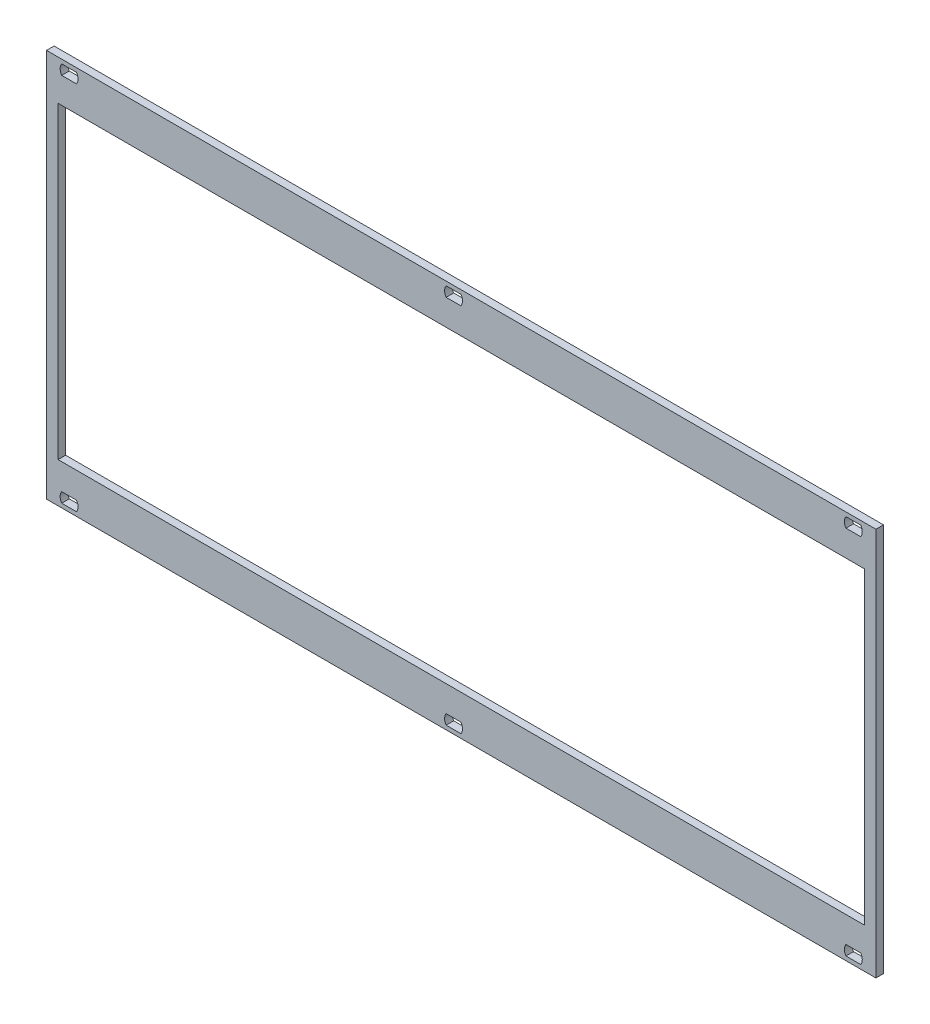
ISO-10303-21;
HEADER;
FILE_DESCRIPTION(('STEP AP214'),'2;1');
FILE_NAME('part.step','',(''),(''),'','','');
FILE_SCHEMA(('AUTOMOTIVE_DESIGN { 1 0 10303 214 1 1 1 1 }'));
ENDSEC;
DATA;
#1=APPLICATION_CONTEXT('core data for automotive mechanical design processes');
#2=APPLICATION_PROTOCOL_DEFINITION('international standard','automotive_design',2000,#1);
#3=PRODUCT_CONTEXT('',#1,'mechanical');
#4=PRODUCT('Part','Part','',(#3));
#5=PRODUCT_RELATED_PRODUCT_CATEGORY('part','',(#4));
#6=PRODUCT_DEFINITION_FORMATION('','',#4);
#7=PRODUCT_DEFINITION_CONTEXT('part definition',#1,'design');
#8=PRODUCT_DEFINITION('design','',#6,#7);
#9=PRODUCT_DEFINITION_SHAPE('','',#8);
#10=(LENGTH_UNIT() NAMED_UNIT(*) SI_UNIT(.MILLI.,.METRE.));
#11=(NAMED_UNIT(*) PLANE_ANGLE_UNIT() SI_UNIT($,.RADIAN.));
#12=(NAMED_UNIT(*) SI_UNIT($,.STERADIAN.) SOLID_ANGLE_UNIT());
#13=UNCERTAINTY_MEASURE_WITH_UNIT(LENGTH_MEASURE(1.E-05),#10,'distance_accuracy_value','');
#14=(GEOMETRIC_REPRESENTATION_CONTEXT(3) GLOBAL_UNCERTAINTY_ASSIGNED_CONTEXT((#13)) GLOBAL_UNIT_ASSIGNED_CONTEXT((#10,
#11,#12)) REPRESENTATION_CONTEXT('',''));
#15=CARTESIAN_POINT('',(0.,0.,0.));
#16=DIRECTION('',(0.,0.,1.));
#17=DIRECTION('',(1.,0.,0.));
#18=AXIS2_PLACEMENT_3D('',#15,#16,#17);
#19=CARTESIAN_POINT('',(-46.657159924507,-6.8405717611313,-2.5));
#20=DIRECTION('',(0.,0.,-1.));
#21=DIRECTION('',(1.,0.,0.));
#22=AXIS2_PLACEMENT_3D('',#19,#20,#21);
#23=PLANE('',#22);
#24=DIRECTION('',(-1.,0.,0.));
#25=VECTOR('',#24,1.);
#26=CARTESIAN_POINT('',(97.1823339068895,-125.22056295395,-2.5));
#27=LINE('',#26,#25);
#28=CARTESIAN_POINT('',(230.35733390689,-125.22056295395,-2.5));
#29=VERTEX_POINT('',#28);
#30=CARTESIAN_POINT('',(-35.992666093111,-125.22056295395,-2.5));
#31=VERTEX_POINT('',#30);
#32=EDGE_CURVE('E475',#29,#31,#27,.T.);
#33=ORIENTED_EDGE('',*,*,#32,.F.);
#34=DIRECTION('',(0.,-1.,0.));
#35=VECTOR('',#34,1.);
#36=CARTESIAN_POINT('',(230.35733390689,-74.2505629539495,-2.5));
#37=LINE('',#36,#35);
#38=CARTESIAN_POINT('',(230.35733390689,-23.280562953949,-2.5));
#39=VERTEX_POINT('',#38);
#40=EDGE_CURVE('E482',#39,#29,#37,.T.);
#41=ORIENTED_EDGE('',*,*,#40,.F.);
#42=DIRECTION('',(1.,0.,0.));
#43=VECTOR('',#42,1.);
#44=CARTESIAN_POINT('',(97.1823339068895,-23.280562953949,-2.5));
#45=LINE('',#44,#43);
#46=CARTESIAN_POINT('',(-35.992666093111,-23.280562953949,-2.5));
#47=VERTEX_POINT('',#46);
#48=EDGE_CURVE('E462',#47,#39,#45,.T.);
#49=ORIENTED_EDGE('',*,*,#48,.F.);
#50=DIRECTION('',(0.,1.,0.));
#51=VECTOR('',#50,1.);
#52=CARTESIAN_POINT('',(-35.992666093111,-74.2505629539495,-2.5));
#53=LINE('',#52,#51);
#54=EDGE_CURVE('E468',#31,#47,#53,.T.);
#55=ORIENTED_EDGE('',*,*,#54,.F.);
#56=EDGE_LOOP('',(#33,#41,#49,#55));
#57=FACE_BOUND('',#56,.T.);
#58=DIRECTION('',(-1.,0.,0.));
#59=VECTOR('',#58,1.);
#60=CARTESIAN_POINT('',(-32.3576660931125,-133.80056295395,-2.5));
#61=LINE('',#60,#59);
#62=CARTESIAN_POINT('',(-29.9122622409854,-133.80056295395,-2.5));
#63=VERTEX_POINT('',#62);
#64=CARTESIAN_POINT('',(-34.8030699452408,-133.80056295395,-2.5));
#65=VERTEX_POINT('',#64);
#66=EDGE_CURVE('E224',#63,#65,#61,.T.);
#67=ORIENTED_EDGE('',*,*,#66,.T.);
#68=CARTESIAN_POINT('',(-32.3576660931077,-135.450562953948,-2.5));
#69=DIRECTION('',(0.,0.,-1.));
#70=DIRECTION('',(-1.,0.,0.));
#71=AXIS2_PLACEMENT_3D('',#68,#69,#70);
#72=CIRCLE('',#71,2.95000000000335);
#73=CARTESIAN_POINT('',(-34.8030699452419,-137.100562953945,-2.5));
#74=VERTEX_POINT('',#73);
#75=EDGE_CURVE('E20',#65,#74,#72,.F.);
#76=ORIENTED_EDGE('',*,*,#75,.T.);
#77=DIRECTION('',(1.,0.,0.));
#78=VECTOR('',#77,1.);
#79=CARTESIAN_POINT('',(-32.3576660931125,-137.10056295395,-2.5));
#80=LINE('',#79,#78);
#81=CARTESIAN_POINT('',(-29.9122622409826,-137.10056295395,-2.5));
#82=VERTEX_POINT('',#81);
#83=EDGE_CURVE('E228',#74,#82,#80,.T.);
#84=ORIENTED_EDGE('',*,*,#83,.T.);
#85=CARTESIAN_POINT('',(-32.3576660931107,-135.450562953954,-2.5));
#86=DIRECTION('',(0.,0.,-1.));
#87=DIRECTION('',(-1.,0.,0.));
#88=AXIS2_PLACEMENT_3D('',#85,#86,#87);
#89=CIRCLE('',#88,2.94999999999935);
#90=EDGE_CURVE('E422',#82,#63,#89,.F.);
#91=ORIENTED_EDGE('',*,*,#90,.T.);
#92=EDGE_LOOP('',(#67,#76,#84,#91));
#93=FACE_BOUND('',#92,.T.);
#94=DIRECTION('',(-1.,0.,0.));
#95=VECTOR('',#94,1.);
#96=CARTESIAN_POINT('',(94.6423339068875,-133.80056295395,-2.5));
#97=LINE('',#96,#95);
#98=CARTESIAN_POINT('',(97.0877377590146,-133.80056295395,-2.5));
#99=VERTEX_POINT('',#98);
#100=CARTESIAN_POINT('',(92.1969300547592,-133.80056295395,-2.5));
#101=VERTEX_POINT('',#100);
#102=EDGE_CURVE('E329',#99,#101,#97,.T.);
#103=ORIENTED_EDGE('',*,*,#102,.T.);
#104=CARTESIAN_POINT('',(94.6423339068947,-135.450562953948,-2.5));
#105=DIRECTION('',(0.,0.,-1.));
#106=DIRECTION('',(-1.,0.,0.));
#107=AXIS2_PLACEMENT_3D('',#104,#105,#106);
#108=CIRCLE('',#107,2.95000000000533);
#109=CARTESIAN_POINT('',(92.1969300547581,-137.100562953945,-2.5));
#110=VERTEX_POINT('',#109);
#111=EDGE_CURVE('E328',#101,#110,#108,.F.);
#112=ORIENTED_EDGE('',*,*,#111,.T.);
#113=DIRECTION('',(1.,0.,0.));
#114=VECTOR('',#113,1.);
#115=CARTESIAN_POINT('',(94.6423339068875,-137.10056295395,-2.5));
#116=LINE('',#115,#114);
#117=CARTESIAN_POINT('',(97.0877377590174,-137.10056295395,-2.5));
#118=VERTEX_POINT('',#117);
#119=EDGE_CURVE('E325',#110,#118,#116,.T.);
#120=ORIENTED_EDGE('',*,*,#119,.T.);
#121=CARTESIAN_POINT('',(94.6423339068883,-135.450562953954,-2.5));
#122=DIRECTION('',(0.,0.,-1.));
#123=DIRECTION('',(-1.,0.,0.));
#124=AXIS2_PLACEMENT_3D('',#121,#122,#123);
#125=CIRCLE('',#124,2.95000000000015);
#126=EDGE_CURVE('E417',#118,#99,#125,.F.);
#127=ORIENTED_EDGE('',*,*,#126,.T.);
#128=EDGE_LOOP('',(#103,#112,#120,#127));
#129=FACE_BOUND('',#128,.T.);
#130=DIRECTION('',(-1.,0.,0.));
#131=VECTOR('',#130,1.);
#132=CARTESIAN_POINT('',(226.72233390689,-133.80056295395,-2.5));
#133=LINE('',#132,#131);
#134=CARTESIAN_POINT('',(229.167737759018,-133.80056295395,-2.5));
#135=VERTEX_POINT('',#134);
#136=CARTESIAN_POINT('',(224.276930054758,-133.80056295395,-2.5));
#137=VERTEX_POINT('',#136);
#138=EDGE_CURVE('E320',#135,#137,#133,.T.);
#139=ORIENTED_EDGE('',*,*,#138,.T.);
#140=CARTESIAN_POINT('',(226.722333906902,-135.450562953948,-2.5));
#141=DIRECTION('',(0.,0.,-1.));
#142=DIRECTION('',(-1.,0.,0.));
#143=AXIS2_PLACEMENT_3D('',#140,#141,#142);
#144=CIRCLE('',#143,2.95000000001495);
#145=CARTESIAN_POINT('',(224.276930054754,-137.100562953945,-2.5));
#146=VERTEX_POINT('',#145);
#147=EDGE_CURVE('E318',#137,#146,#144,.F.);
#148=ORIENTED_EDGE('',*,*,#147,.T.);
#149=DIRECTION('',(1.,0.,0.));
#150=VECTOR('',#149,1.);
#151=CARTESIAN_POINT('',(226.72233390689,-137.10056295395,-2.5));
#152=LINE('',#151,#150);
#153=CARTESIAN_POINT('',(229.167737759021,-137.10056295395,-2.5));
#154=VERTEX_POINT('',#153);
#155=EDGE_CURVE('E315',#146,#154,#152,.T.);
#156=ORIENTED_EDGE('',*,*,#155,.T.);
#157=CARTESIAN_POINT('',(226.722333906873,-135.450562953954,-2.5));
#158=DIRECTION('',(0.,0.,-1.));
#159=DIRECTION('',(-1.,0.,0.));
#160=AXIS2_PLACEMENT_3D('',#157,#158,#159);
#161=CIRCLE('',#160,2.95000000001563);
#162=EDGE_CURVE('E411',#154,#135,#161,.F.);
#163=ORIENTED_EDGE('',*,*,#162,.T.);
#164=EDGE_LOOP('',(#139,#148,#156,#163));
#165=FACE_BOUND('',#164,.T.);
#166=DIRECTION('',(-1.,0.,0.));
#167=VECTOR('',#166,1.);
#168=CARTESIAN_POINT('',(-32.357666093113,-11.400562953949,-2.5));
#169=LINE('',#168,#167);
#170=CARTESIAN_POINT('',(-29.9122622409842,-11.400562953949,-2.5));
#171=VERTEX_POINT('',#170);
#172=CARTESIAN_POINT('',(-34.8030699452411,-11.400562953949,-2.5));
#173=VERTEX_POINT('',#172);
#174=EDGE_CURVE('E310',#171,#173,#169,.T.);
#175=ORIENTED_EDGE('',*,*,#174,.T.);
#176=CARTESIAN_POINT('',(-32.3576660931109,-13.0505629539476,-2.5));
#177=DIRECTION('',(0.,0.,-1.));
#178=DIRECTION('',(-1.,0.,0.));
#179=AXIS2_PLACEMENT_3D('',#176,#177,#178);
#180=CIRCLE('',#179,2.95000000000065);
#181=CARTESIAN_POINT('',(-34.8030699452426,-14.700562953943,-2.5));
#182=VERTEX_POINT('',#181);
#183=EDGE_CURVE('E308',#173,#182,#180,.F.);
#184=ORIENTED_EDGE('',*,*,#183,.T.);
#185=DIRECTION('',(1.,0.,0.));
#186=VECTOR('',#185,1.);
#187=CARTESIAN_POINT('',(-32.357666093113,-14.700562953949,-2.5));
#188=LINE('',#187,#186);
#189=CARTESIAN_POINT('',(-29.9122622409838,-14.700562953949,-2.5));
#190=VERTEX_POINT('',#189);
#191=EDGE_CURVE('E305',#182,#190,#188,.T.);
#192=ORIENTED_EDGE('',*,*,#191,.T.);
#193=CARTESIAN_POINT('',(-32.3576660931133,-13.0505629539496,-2.5));
#194=DIRECTION('',(0.,0.,-1.));
#195=DIRECTION('',(-1.,0.,0.));
#196=AXIS2_PLACEMENT_3D('',#193,#194,#195);
#197=CIRCLE('',#196,2.95000000000147);
#198=EDGE_CURVE('E405',#190,#171,#197,.F.);
#199=ORIENTED_EDGE('',*,*,#198,.T.);
#200=EDGE_LOOP('',(#175,#184,#192,#199));
#201=FACE_BOUND('',#200,.T.);
#202=DIRECTION('',(-1.,0.,0.));
#203=VECTOR('',#202,1.);
#204=CARTESIAN_POINT('',(94.642333906887,-11.400562953948,-2.5));
#205=LINE('',#204,#203);
#206=CARTESIAN_POINT('',(97.0877377590161,-11.400562953948,-2.5));
#207=VERTEX_POINT('',#206);
#208=CARTESIAN_POINT('',(92.1969300547597,-11.400562953948,-2.5));
#209=VERTEX_POINT('',#208);
#210=EDGE_CURVE('E300',#207,#209,#205,.T.);
#211=ORIENTED_EDGE('',*,*,#210,.T.);
#212=CARTESIAN_POINT('',(94.6423339068888,-13.0505629539488,-2.5));
#213=DIRECTION('',(0.,0.,-1.));
#214=DIRECTION('',(-1.,0.,0.));
#215=AXIS2_PLACEMENT_3D('',#212,#213,#214);
#216=CIRCLE('',#215,2.95000000000039);
#217=CARTESIAN_POINT('',(92.1969300547566,-14.7005629539425,-2.5));
#218=VERTEX_POINT('',#217);
#219=EDGE_CURVE('E298',#209,#218,#216,.F.);
#220=ORIENTED_EDGE('',*,*,#219,.T.);
#221=DIRECTION('',(1.,0.,0.));
#222=VECTOR('',#221,1.);
#223=CARTESIAN_POINT('',(94.642333906887,-14.700562953948,-2.5));
#224=LINE('',#223,#222);
#225=CARTESIAN_POINT('',(97.0877377590159,-14.700562953948,-2.5));
#226=VERTEX_POINT('',#225);
#227=EDGE_CURVE('E295',#218,#226,#224,.T.);
#228=ORIENTED_EDGE('',*,*,#227,.T.);
#229=CARTESIAN_POINT('',(94.6423339068884,-13.0505629539476,-2.5));
#230=DIRECTION('',(0.,0.,-1.));
#231=DIRECTION('',(-1.,0.,0.));
#232=AXIS2_PLACEMENT_3D('',#229,#230,#231);
#233=CIRCLE('',#232,2.95000000000012);
#234=EDGE_CURVE('E399',#226,#207,#233,.F.);
#235=ORIENTED_EDGE('',*,*,#234,.T.);
#236=EDGE_LOOP('',(#211,#220,#228,#235));
#237=FACE_BOUND('',#236,.T.);
#238=DIRECTION('',(-1.,0.,0.));
#239=VECTOR('',#238,1.);
#240=CARTESIAN_POINT('',(226.72233390689,-11.400562953947,-2.5));
#241=LINE('',#240,#239);
#242=CARTESIAN_POINT('',(229.16773775902,-11.400562953947,-2.5));
#243=VERTEX_POINT('',#242);
#244=CARTESIAN_POINT('',(224.276930054759,-11.400562953947,-2.5));
#245=VERTEX_POINT('',#244);
#246=EDGE_CURVE('E290',#243,#245,#241,.T.);
#247=ORIENTED_EDGE('',*,*,#246,.T.);
#248=CARTESIAN_POINT('',(226.722333906898,-13.050562953948,-2.5));
#249=DIRECTION('',(0.,0.,-1.));
#250=DIRECTION('',(-1.,0.,0.));
#251=AXIS2_PLACEMENT_3D('',#248,#249,#250);
#252=CIRCLE('',#251,2.95000000001048);
#253=CARTESIAN_POINT('',(224.276930054754,-14.7005629539415,-2.5));
#254=VERTEX_POINT('',#253);
#255=EDGE_CURVE('E288',#245,#254,#252,.F.);
#256=ORIENTED_EDGE('',*,*,#255,.T.);
#257=DIRECTION('',(1.,0.,0.));
#258=VECTOR('',#257,1.);
#259=CARTESIAN_POINT('',(226.72233390689,-14.700562953947,-2.5));
#260=LINE('',#259,#258);
#261=CARTESIAN_POINT('',(229.16773775902,-14.700562953947,-2.5));
#262=VERTEX_POINT('',#261);
#263=EDGE_CURVE('E285',#254,#262,#260,.T.);
#264=ORIENTED_EDGE('',*,*,#263,.T.);
#265=CARTESIAN_POINT('',(226.722333906873,-13.0505629539468,-2.5));
#266=DIRECTION('',(0.,0.,-1.));
#267=DIRECTION('',(-1.,0.,0.));
#268=AXIS2_PLACEMENT_3D('',#265,#266,#267);
#269=CIRCLE('',#268,2.95000000001558);
#270=EDGE_CURVE('E393',#262,#243,#269,.F.);
#271=ORIENTED_EDGE('',*,*,#270,.T.);
#272=EDGE_LOOP('',(#247,#256,#264,#271));
#273=FACE_BOUND('',#272,.T.);
#274=DIRECTION('',(1.,0.,0.));
#275=VECTOR('',#274,1.);
#276=CARTESIAN_POINT('',(97.1823339068895,-138.45056295395,-2.5));
#277=LINE('',#276,#275);
#278=CARTESIAN_POINT('',(-39.807666093111,-138.45056295395,-2.5));
#279=VERTEX_POINT('',#278);
#280=CARTESIAN_POINT('',(234.17233390689,-138.45056295395,-2.5));
#281=VERTEX_POINT('',#280);
#282=EDGE_CURVE('E275',#279,#281,#277,.T.);
#283=ORIENTED_EDGE('',*,*,#282,.F.);
#284=DIRECTION('',(0.,-1.,0.));
#285=VECTOR('',#284,1.);
#286=CARTESIAN_POINT('',(-39.807666093111,-74.2505629539495,-2.5));
#287=LINE('',#286,#285);
#288=CARTESIAN_POINT('',(-39.807666093111,-10.050562953949,-2.5));
#289=VERTEX_POINT('',#288);
#290=EDGE_CURVE('E282',#289,#279,#287,.T.);
#291=ORIENTED_EDGE('',*,*,#290,.F.);
#292=DIRECTION('',(-1.,0.,0.));
#293=VECTOR('',#292,1.);
#294=CARTESIAN_POINT('',(97.1823339068895,-10.050562953949,-2.5));
#295=LINE('',#294,#293);
#296=CARTESIAN_POINT('',(234.17233390689,-10.050562953949,-2.5));
#297=VERTEX_POINT('',#296);
#298=EDGE_CURVE('E260',#297,#289,#295,.T.);
#299=ORIENTED_EDGE('',*,*,#298,.F.);
#300=DIRECTION('',(0.,1.,0.));
#301=VECTOR('',#300,1.);
#302=CARTESIAN_POINT('',(234.17233390689,-74.2505629539495,-2.5));
#303=LINE('',#302,#301);
#304=EDGE_CURVE('E268',#281,#297,#303,.T.);
#305=ORIENTED_EDGE('',*,*,#304,.F.);
#306=EDGE_LOOP('',(#283,#291,#299,#305));
#307=FACE_BOUND('',#306,.T.);
#308=ADVANCED_FACE('F16',(#57,#93,#129,#165,#201,#237,#273,#307),#23,.T.);
#309=CARTESIAN_POINT('',(-39.807666093111,-138.45056295395,0.));
#310=DIRECTION('',(-1.,0.,0.));
#311=DIRECTION('',(0.,1.,0.));
#312=AXIS2_PLACEMENT_3D('',#309,#310,#311);
#313=PLANE('',#312);
#314=ORIENTED_EDGE('',*,*,#290,.T.);
#315=DIRECTION('',(0.,0.,-1.));
#316=VECTOR('',#315,1.);
#317=CARTESIAN_POINT('',(-39.807666093111,-138.45056295395,-1.25));
#318=LINE('',#317,#316);
#319=CARTESIAN_POINT('',(-39.807666093111,-138.45056295395,0.));
#320=VERTEX_POINT('',#319);
#321=EDGE_CURVE('E278',#320,#279,#318,.T.);
#322=ORIENTED_EDGE('',*,*,#321,.F.);
#323=DIRECTION('',(0.,-1.,0.));
#324=VECTOR('',#323,1.);
#325=CARTESIAN_POINT('',(-39.807666093111,-74.2505639791506,0.));
#326=LINE('',#325,#324);
#327=CARTESIAN_POINT('',(-39.807666093111,-10.050562953949,0.));
#328=VERTEX_POINT('',#327);
#329=EDGE_CURVE('E454',#328,#320,#326,.T.);
#330=ORIENTED_EDGE('',*,*,#329,.F.);
#331=DIRECTION('',(0.,0.,1.));
#332=VECTOR('',#331,1.);
#333=CARTESIAN_POINT('',(-39.807666093111,-10.050562953949,-1.25));
#334=LINE('',#333,#332);
#335=EDGE_CURVE('E242',#289,#328,#334,.T.);
#336=ORIENTED_EDGE('',*,*,#335,.F.);
#337=EDGE_LOOP('',(#314,#322,#330,#336));
#338=FACE_BOUND('',#337,.T.);
#339=ADVANCED_FACE('F661',(#338),#313,.T.);
#340=CARTESIAN_POINT('',(234.17233390689,-138.45056295395,0.));
#341=DIRECTION('',(0.,-1.,0.));
#342=DIRECTION('',(-1.,0.,0.));
#343=AXIS2_PLACEMENT_3D('',#340,#341,#342);
#344=PLANE('',#343);
#345=ORIENTED_EDGE('',*,*,#282,.T.);
#346=DIRECTION('',(0.,0.,-1.));
#347=VECTOR('',#346,1.);
#348=CARTESIAN_POINT('',(234.17233390689,-138.45056295395,-1.25));
#349=LINE('',#348,#347);
#350=CARTESIAN_POINT('',(234.17233390689,-138.45056295395,0.));
#351=VERTEX_POINT('',#350);
#352=EDGE_CURVE('E271',#351,#281,#349,.T.);
#353=ORIENTED_EDGE('',*,*,#352,.F.);
#354=DIRECTION('',(1.,0.,0.));
#355=VECTOR('',#354,1.);
#356=CARTESIAN_POINT('',(97.1823334693915,-138.45056295395,0.));
#357=LINE('',#356,#355);
#358=EDGE_CURVE('E450',#320,#351,#357,.T.);
#359=ORIENTED_EDGE('',*,*,#358,.F.);
#360=ORIENTED_EDGE('',*,*,#321,.T.);
#361=EDGE_LOOP('',(#345,#353,#359,#360));
#362=FACE_BOUND('',#361,.T.);
#363=ADVANCED_FACE('F652',(#362),#344,.T.);
#364=CARTESIAN_POINT('',(234.17233390689,-10.050562953949,0.));
#365=DIRECTION('',(1.,0.,0.));
#366=DIRECTION('',(0.,-1.,0.));
#367=AXIS2_PLACEMENT_3D('',#364,#365,#366);
#368=PLANE('',#367);
#369=ORIENTED_EDGE('',*,*,#304,.T.);
#370=DIRECTION('',(0.,0.,-1.));
#371=VECTOR('',#370,1.);
#372=CARTESIAN_POINT('',(234.17233390689,-10.050562953949,-1.25));
#373=LINE('',#372,#371);
#374=CARTESIAN_POINT('',(234.17233390689,-10.050562953949,0.));
#375=VERTEX_POINT('',#374);
#376=EDGE_CURVE('E264',#375,#297,#373,.T.);
#377=ORIENTED_EDGE('',*,*,#376,.F.);
#378=DIRECTION('',(0.,1.,0.));
#379=VECTOR('',#378,1.);
#380=CARTESIAN_POINT('',(234.17233390689,-74.2505639791506,0.));
#381=LINE('',#380,#379);
#382=EDGE_CURVE('E443',#351,#375,#381,.T.);
#383=ORIENTED_EDGE('',*,*,#382,.F.);
#384=ORIENTED_EDGE('',*,*,#352,.T.);
#385=EDGE_LOOP('',(#369,#377,#383,#384));
#386=FACE_BOUND('',#385,.T.);
#387=ADVANCED_FACE('F641',(#386),#368,.T.);
#388=CARTESIAN_POINT('',(-39.807666093111,-10.050562953949,0.));
#389=DIRECTION('',(0.,1.,0.));
#390=DIRECTION('',(1.,0.,0.));
#391=AXIS2_PLACEMENT_3D('',#388,#389,#390);
#392=PLANE('',#391);
#393=ORIENTED_EDGE('',*,*,#298,.T.);
#394=ORIENTED_EDGE('',*,*,#335,.T.);
#395=DIRECTION('',(-1.,0.,0.));
#396=VECTOR('',#395,1.);
#397=CARTESIAN_POINT('',(97.1823334693915,-10.050562953949,0.));
#398=LINE('',#397,#396);
#399=EDGE_CURVE('E439',#375,#328,#398,.T.);
#400=ORIENTED_EDGE('',*,*,#399,.F.);
#401=ORIENTED_EDGE('',*,*,#376,.T.);
#402=EDGE_LOOP('',(#393,#394,#400,#401));
#403=FACE_BOUND('',#402,.T.);
#404=ADVANCED_FACE('F636',(#403),#392,.T.);
#405=CARTESIAN_POINT('',(-29.912262240984,-137.10056295395,0.));
#406=DIRECTION('',(0.,-1.,0.));
#407=DIRECTION('',(-1.,0.,0.));
#408=AXIS2_PLACEMENT_3D('',#405,#406,#407);
#409=PLANE('',#408);
#410=DIRECTION('',(-1.,0.,0.));
#411=VECTOR('',#410,1.);
#412=CARTESIAN_POINT('',(97.1823334693915,-137.10056295395,0.));
#413=LINE('',#412,#411);
#414=CARTESIAN_POINT('',(-29.9122622409826,-137.10056295395,0.));
#415=VERTEX_POINT('',#414);
#416=CARTESIAN_POINT('',(-34.8030699452419,-137.100562953945,0.));
#417=VERTEX_POINT('',#416);
#418=EDGE_CURVE('E392',#415,#417,#413,.T.);
#419=ORIENTED_EDGE('',*,*,#418,.F.);
#420=DIRECTION('',(0.,0.,-1.));
#421=VECTOR('',#420,1.);
#422=CARTESIAN_POINT('',(-29.912262240984,-137.10056295395,-1.75));
#423=LINE('',#422,#421);
#424=EDGE_CURVE('E239',#415,#82,#423,.T.);
#425=ORIENTED_EDGE('',*,*,#424,.T.);
#426=ORIENTED_EDGE('',*,*,#83,.F.);
#427=DIRECTION('',(0.,0.,1.));
#428=VECTOR('',#427,1.);
#429=CARTESIAN_POINT('',(-34.803069945246,-137.10056295394,-1.75));
#430=LINE('',#429,#428);
#431=EDGE_CURVE('E234',#74,#417,#430,.T.);
#432=ORIENTED_EDGE('',*,*,#431,.T.);
#433=EDGE_LOOP('',(#419,#425,#426,#432));
#434=FACE_BOUND('',#433,.T.);
#435=ADVANCED_FACE('F236',(#434),#409,.F.);
#436=CARTESIAN_POINT('',(-32.3576660931077,-135.450562953948,0.));
#437=DIRECTION('',(0.,0.,-1.));
#438=DIRECTION('',(-1.,0.,0.));
#439=AXIS2_PLACEMENT_3D('',#436,#437,#438);
#440=CYLINDRICAL_SURFACE('',#439,2.95000000000335);
#441=CARTESIAN_POINT('',(-32.3576660931077,-135.450562953948,0.));
#442=DIRECTION('',(0.,0.,-1.));
#443=DIRECTION('',(-1.,0.,0.));
#444=AXIS2_PLACEMENT_3D('',#441,#442,#443);
#445=CIRCLE('',#444,2.95000000000335);
#446=CARTESIAN_POINT('',(-34.8030699452408,-133.80056295395,0.));
#447=VERTEX_POINT('',#446);
#448=EDGE_CURVE('E246',#417,#447,#445,.T.);
#449=ORIENTED_EDGE('',*,*,#448,.F.);
#450=ORIENTED_EDGE('',*,*,#431,.F.);
#451=ORIENTED_EDGE('',*,*,#75,.F.);
#452=DIRECTION('',(0.,0.,1.));
#453=VECTOR('',#452,1.);
#454=CARTESIAN_POINT('',(-34.803069945241,-133.80056295395,-1.75));
#455=LINE('',#454,#453);
#456=EDGE_CURVE('E252',#65,#447,#455,.T.);
#457=ORIENTED_EDGE('',*,*,#456,.T.);
#458=EDGE_LOOP('',(#449,#450,#451,#457));
#459=FACE_BOUND('',#458,.T.);
#460=ADVANCED_FACE('F244',(#459),#440,.F.);
#461=CARTESIAN_POINT('',(-34.803069945241,-133.80056295395,0.));
#462=DIRECTION('',(0.,1.,0.));
#463=DIRECTION('',(1.,0.,0.));
#464=AXIS2_PLACEMENT_3D('',#461,#462,#463);
#465=PLANE('',#464);
#466=DIRECTION('',(1.,0.,0.));
#467=VECTOR('',#466,1.);
#468=CARTESIAN_POINT('',(97.1823334693915,-133.80056295395,0.));
#469=LINE('',#468,#467);
#470=CARTESIAN_POINT('',(-29.9122622409854,-133.80056295395,0.));
#471=VERTEX_POINT('',#470);
#472=EDGE_CURVE('E389',#447,#471,#469,.T.);
#473=ORIENTED_EDGE('',*,*,#472,.F.);
#474=ORIENTED_EDGE('',*,*,#456,.F.);
#475=ORIENTED_EDGE('',*,*,#66,.F.);
#476=DIRECTION('',(0.,0.,1.));
#477=VECTOR('',#476,1.);
#478=CARTESIAN_POINT('',(-29.912262240984,-133.80056295395,-1.75));
#479=LINE('',#478,#477);
#480=EDGE_CURVE('E424',#63,#471,#479,.T.);
#481=ORIENTED_EDGE('',*,*,#480,.T.);
#482=EDGE_LOOP('',(#473,#474,#475,#481));
#483=FACE_BOUND('',#482,.T.);
#484=ADVANCED_FACE('F431',(#483),#465,.F.);
#485=CARTESIAN_POINT('',(-32.3576660931107,-135.450562953954,0.));
#486=DIRECTION('',(0.,0.,-1.));
#487=DIRECTION('',(-1.,0.,0.));
#488=AXIS2_PLACEMENT_3D('',#485,#486,#487);
#489=CYLINDRICAL_SURFACE('',#488,2.94999999999935);
#490=CARTESIAN_POINT('',(-32.3576660931107,-135.450562953954,0.));
#491=DIRECTION('',(0.,0.,-1.));
#492=DIRECTION('',(-1.,0.,0.));
#493=AXIS2_PLACEMENT_3D('',#490,#491,#492);
#494=CIRCLE('',#493,2.94999999999935);
#495=EDGE_CURVE('E385',#471,#415,#494,.T.);
#496=ORIENTED_EDGE('',*,*,#495,.F.);
#497=ORIENTED_EDGE('',*,*,#480,.F.);
#498=ORIENTED_EDGE('',*,*,#90,.F.);
#499=ORIENTED_EDGE('',*,*,#424,.F.);
#500=EDGE_LOOP('',(#496,#497,#498,#499));
#501=FACE_BOUND('',#500,.T.);
#502=ADVANCED_FACE('F747',(#501),#489,.F.);
#503=CARTESIAN_POINT('',(97.087737759016,-137.10056295395,0.));
#504=DIRECTION('',(0.,-1.,0.));
#505=DIRECTION('',(-1.,0.,0.));
#506=AXIS2_PLACEMENT_3D('',#503,#504,#505);
#507=PLANE('',#506);
#508=DIRECTION('',(-1.,0.,0.));
#509=VECTOR('',#508,1.);
#510=CARTESIAN_POINT('',(97.1823334693915,-137.10056295395,0.));
#511=LINE('',#510,#509);
#512=CARTESIAN_POINT('',(97.0877377590174,-137.10056295395,0.));
#513=VERTEX_POINT('',#512);
#514=CARTESIAN_POINT('',(92.1969300547581,-137.100562953945,0.));
#515=VERTEX_POINT('',#514);
#516=EDGE_CURVE('E384',#513,#515,#511,.T.);
#517=ORIENTED_EDGE('',*,*,#516,.F.);
#518=DIRECTION('',(0.,0.,-1.));
#519=VECTOR('',#518,1.);
#520=CARTESIAN_POINT('',(97.087737759016,-137.10056295395,-1.75));
#521=LINE('',#520,#519);
#522=EDGE_CURVE('E319',#513,#118,#521,.T.);
#523=ORIENTED_EDGE('',*,*,#522,.T.);
#524=ORIENTED_EDGE('',*,*,#119,.F.);
#525=DIRECTION('',(0.,0.,1.));
#526=VECTOR('',#525,1.);
#527=CARTESIAN_POINT('',(92.196930054754,-137.10056295394,-1.75));
#528=LINE('',#527,#526);
#529=EDGE_CURVE('E332',#110,#515,#528,.T.);
#530=ORIENTED_EDGE('',*,*,#529,.T.);
#531=EDGE_LOOP('',(#517,#523,#524,#530));
#532=FACE_BOUND('',#531,.T.);
#533=ADVANCED_FACE('F537',(#532),#507,.F.);
#534=CARTESIAN_POINT('',(94.6423339068947,-135.450562953948,0.));
#535=DIRECTION('',(0.,0.,-1.));
#536=DIRECTION('',(-1.,0.,0.));
#537=AXIS2_PLACEMENT_3D('',#534,#535,#536);
#538=CYLINDRICAL_SURFACE('',#537,2.95000000000533);
#539=CARTESIAN_POINT('',(94.6423339068947,-135.450562953948,0.));
#540=DIRECTION('',(0.,0.,-1.));
#541=DIRECTION('',(-1.,0.,0.));
#542=AXIS2_PLACEMENT_3D('',#539,#540,#541);
#543=CIRCLE('',#542,2.95000000000533);
#544=CARTESIAN_POINT('',(92.1969300547592,-133.80056295395,0.));
#545=VERTEX_POINT('',#544);
#546=EDGE_CURVE('E380',#515,#545,#543,.T.);
#547=ORIENTED_EDGE('',*,*,#546,.F.);
#548=ORIENTED_EDGE('',*,*,#529,.F.);
#549=ORIENTED_EDGE('',*,*,#111,.F.);
#550=DIRECTION('',(0.,0.,1.));
#551=VECTOR('',#550,1.);
#552=CARTESIAN_POINT('',(92.196930054759,-133.80056295395,-1.75));
#553=LINE('',#552,#551);
#554=EDGE_CURVE('E331',#101,#545,#553,.T.);
#555=ORIENTED_EDGE('',*,*,#554,.T.);
#556=EDGE_LOOP('',(#547,#548,#549,#555));
#557=FACE_BOUND('',#556,.T.);
#558=ADVANCED_FACE('F542',(#557),#538,.F.);
#559=CARTESIAN_POINT('',(92.196930054759,-133.80056295395,0.));
#560=DIRECTION('',(0.,1.,0.));
#561=DIRECTION('',(1.,0.,0.));
#562=AXIS2_PLACEMENT_3D('',#559,#560,#561);
#563=PLANE('',#562);
#564=DIRECTION('',(1.,0.,0.));
#565=VECTOR('',#564,1.);
#566=CARTESIAN_POINT('',(97.1823334693915,-133.80056295395,0.));
#567=LINE('',#566,#565);
#568=CARTESIAN_POINT('',(97.0877377590146,-133.80056295395,0.));
#569=VERTEX_POINT('',#568);
#570=EDGE_CURVE('E379',#545,#569,#567,.T.);
#571=ORIENTED_EDGE('',*,*,#570,.F.);
#572=ORIENTED_EDGE('',*,*,#554,.F.);
#573=ORIENTED_EDGE('',*,*,#102,.F.);
#574=DIRECTION('',(0.,0.,1.));
#575=VECTOR('',#574,1.);
#576=CARTESIAN_POINT('',(97.087737759016,-133.80056295395,-1.75));
#577=LINE('',#576,#575);
#578=EDGE_CURVE('E420',#99,#569,#577,.T.);
#579=ORIENTED_EDGE('',*,*,#578,.T.);
#580=EDGE_LOOP('',(#571,#572,#573,#579));
#581=FACE_BOUND('',#580,.T.);
#582=ADVANCED_FACE('F770',(#581),#563,.F.);
#583=CARTESIAN_POINT('',(94.6423339068883,-135.450562953954,0.));
#584=DIRECTION('',(0.,0.,-1.));
#585=DIRECTION('',(-1.,0.,0.));
#586=AXIS2_PLACEMENT_3D('',#583,#584,#585);
#587=CYLINDRICAL_SURFACE('',#586,2.95000000000015);
#588=CARTESIAN_POINT('',(94.6423339068883,-135.450562953954,0.));
#589=DIRECTION('',(0.,0.,-1.));
#590=DIRECTION('',(-1.,0.,0.));
#591=AXIS2_PLACEMENT_3D('',#588,#589,#590);
#592=CIRCLE('',#591,2.95000000000015);
#593=EDGE_CURVE('E375',#569,#513,#592,.T.);
#594=ORIENTED_EDGE('',*,*,#593,.F.);
#595=ORIENTED_EDGE('',*,*,#578,.F.);
#596=ORIENTED_EDGE('',*,*,#126,.F.);
#597=ORIENTED_EDGE('',*,*,#522,.F.);
#598=EDGE_LOOP('',(#594,#595,#596,#597));
#599=FACE_BOUND('',#598,.T.);
#600=ADVANCED_FACE('F778',(#599),#587,.F.);
#601=CARTESIAN_POINT('',(229.16773775902,-137.10056295395,0.));
#602=DIRECTION('',(0.,-1.,0.));
#603=DIRECTION('',(-1.,0.,0.));
#604=AXIS2_PLACEMENT_3D('',#601,#602,#603);
#605=PLANE('',#604);
#606=DIRECTION('',(-1.,0.,0.));
#607=VECTOR('',#606,1.);
#608=CARTESIAN_POINT('',(97.1823334693915,-137.10056295395,0.));
#609=LINE('',#608,#607);
#610=CARTESIAN_POINT('',(229.167737759021,-137.10056295395,0.));
#611=VERTEX_POINT('',#610);
#612=CARTESIAN_POINT('',(224.276930054754,-137.100562953945,0.));
#613=VERTEX_POINT('',#612);
#614=EDGE_CURVE('E374',#611,#613,#609,.T.);
#615=ORIENTED_EDGE('',*,*,#614,.F.);
#616=DIRECTION('',(0.,0.,-1.));
#617=VECTOR('',#616,1.);
#618=CARTESIAN_POINT('',(229.16773775902,-137.10056295395,-1.75));
#619=LINE('',#618,#617);
#620=EDGE_CURVE('E309',#611,#154,#619,.T.);
#621=ORIENTED_EDGE('',*,*,#620,.T.);
#622=ORIENTED_EDGE('',*,*,#155,.F.);
#623=DIRECTION('',(0.,0.,1.));
#624=VECTOR('',#623,1.);
#625=CARTESIAN_POINT('',(224.27693005475,-137.10056295394,-1.75));
#626=LINE('',#625,#624);
#627=EDGE_CURVE('E324',#146,#613,#626,.T.);
#628=ORIENTED_EDGE('',*,*,#627,.T.);
#629=EDGE_LOOP('',(#615,#621,#622,#628));
#630=FACE_BOUND('',#629,.T.);
#631=ADVANCED_FACE('F787',(#630),#605,.F.);
#632=CARTESIAN_POINT('',(226.722333906902,-135.450562953948,0.));
#633=DIRECTION('',(0.,0.,-1.));
#634=DIRECTION('',(-1.,0.,0.));
#635=AXIS2_PLACEMENT_3D('',#632,#633,#634);
#636=CYLINDRICAL_SURFACE('',#635,2.95000000001495);
#637=CARTESIAN_POINT('',(226.722333906902,-135.450562953948,0.));
#638=DIRECTION('',(0.,0.,-1.));
#639=DIRECTION('',(-1.,0.,0.));
#640=AXIS2_PLACEMENT_3D('',#637,#638,#639);
#641=CIRCLE('',#640,2.95000000001495);
#642=CARTESIAN_POINT('',(224.276930054758,-133.80056295395,0.));
#643=VERTEX_POINT('',#642);
#644=EDGE_CURVE('E370',#613,#643,#641,.T.);
#645=ORIENTED_EDGE('',*,*,#644,.F.);
#646=ORIENTED_EDGE('',*,*,#627,.F.);
#647=ORIENTED_EDGE('',*,*,#147,.F.);
#648=DIRECTION('',(0.,0.,1.));
#649=VECTOR('',#648,1.);
#650=CARTESIAN_POINT('',(224.27693005476,-133.80056295395,-1.75));
#651=LINE('',#650,#649);
#652=EDGE_CURVE('E323',#137,#643,#651,.T.);
#653=ORIENTED_EDGE('',*,*,#652,.T.);
#654=EDGE_LOOP('',(#645,#646,#647,#653));
#655=FACE_BOUND('',#654,.T.);
#656=ADVANCED_FACE('F796',(#655),#636,.F.);
#657=CARTESIAN_POINT('',(224.27693005476,-133.80056295395,0.));
#658=DIRECTION('',(0.,1.,0.));
#659=DIRECTION('',(1.,0.,0.));
#660=AXIS2_PLACEMENT_3D('',#657,#658,#659);
#661=PLANE('',#660);
#662=DIRECTION('',(1.,0.,0.));
#663=VECTOR('',#662,1.);
#664=CARTESIAN_POINT('',(97.1823334693915,-133.80056295395,0.));
#665=LINE('',#664,#663);
#666=CARTESIAN_POINT('',(229.167737759018,-133.80056295395,0.));
#667=VERTEX_POINT('',#666);
#668=EDGE_CURVE('E369',#643,#667,#665,.T.);
#669=ORIENTED_EDGE('',*,*,#668,.F.);
#670=ORIENTED_EDGE('',*,*,#652,.F.);
#671=ORIENTED_EDGE('',*,*,#138,.F.);
#672=DIRECTION('',(0.,0.,1.));
#673=VECTOR('',#672,1.);
#674=CARTESIAN_POINT('',(229.16773775902,-133.80056295395,-1.75));
#675=LINE('',#674,#673);
#676=EDGE_CURVE('E414',#135,#667,#675,.T.);
#677=ORIENTED_EDGE('',*,*,#676,.T.);
#678=EDGE_LOOP('',(#669,#670,#671,#677));
#679=FACE_BOUND('',#678,.T.);
#680=ADVANCED_FACE('F805',(#679),#661,.F.);
#681=CARTESIAN_POINT('',(226.722333906873,-135.450562953954,0.));
#682=DIRECTION('',(0.,0.,-1.));
#683=DIRECTION('',(-1.,0.,0.));
#684=AXIS2_PLACEMENT_3D('',#681,#682,#683);
#685=CYLINDRICAL_SURFACE('',#684,2.95000000001563);
#686=CARTESIAN_POINT('',(226.722333906873,-135.450562953954,0.));
#687=DIRECTION('',(0.,0.,-1.));
#688=DIRECTION('',(-1.,0.,0.));
#689=AXIS2_PLACEMENT_3D('',#686,#687,#688);
#690=CIRCLE('',#689,2.95000000001563);
#691=EDGE_CURVE('E365',#667,#611,#690,.T.);
#692=ORIENTED_EDGE('',*,*,#691,.F.);
#693=ORIENTED_EDGE('',*,*,#676,.F.);
#694=ORIENTED_EDGE('',*,*,#162,.F.);
#695=ORIENTED_EDGE('',*,*,#620,.F.);
#696=EDGE_LOOP('',(#692,#693,#694,#695));
#697=FACE_BOUND('',#696,.T.);
#698=ADVANCED_FACE('F814',(#697),#685,.F.);
#699=CARTESIAN_POINT('',(-29.912262240984,-14.700562953949,0.));
#700=DIRECTION('',(0.,-1.,0.));
#701=DIRECTION('',(-1.,0.,0.));
#702=AXIS2_PLACEMENT_3D('',#699,#700,#701);
#703=PLANE('',#702);
#704=DIRECTION('',(-1.,0.,0.));
#705=VECTOR('',#704,1.);
#706=CARTESIAN_POINT('',(97.1823334693915,-14.700562953949,0.));
#707=LINE('',#706,#705);
#708=CARTESIAN_POINT('',(-29.9122622409838,-14.700562953949,0.));
#709=VERTEX_POINT('',#708);
#710=CARTESIAN_POINT('',(-34.8030699452426,-14.700562953943,0.));
#711=VERTEX_POINT('',#710);
#712=EDGE_CURVE('E364',#709,#711,#707,.T.);
#713=ORIENTED_EDGE('',*,*,#712,.F.);
#714=DIRECTION('',(0.,0.,-1.));
#715=VECTOR('',#714,1.);
#716=CARTESIAN_POINT('',(-29.912262240984,-14.700562953949,-1.75));
#717=LINE('',#716,#715);
#718=EDGE_CURVE('E299',#709,#190,#717,.T.);
#719=ORIENTED_EDGE('',*,*,#718,.T.);
#720=ORIENTED_EDGE('',*,*,#191,.F.);
#721=DIRECTION('',(0.,0.,1.));
#722=VECTOR('',#721,1.);
#723=CARTESIAN_POINT('',(-34.803069945247,-14.700562953937,-1.75));
#724=LINE('',#723,#722);
#725=EDGE_CURVE('E314',#182,#711,#724,.T.);
#726=ORIENTED_EDGE('',*,*,#725,.T.);
#727=EDGE_LOOP('',(#713,#719,#720,#726));
#728=FACE_BOUND('',#727,.T.);
#729=ADVANCED_FACE('F823',(#728),#703,.F.);
#730=CARTESIAN_POINT('',(-32.3576660931109,-13.0505629539476,0.));
#731=DIRECTION('',(0.,0.,-1.));
#732=DIRECTION('',(-1.,0.,0.));
#733=AXIS2_PLACEMENT_3D('',#730,#731,#732);
#734=CYLINDRICAL_SURFACE('',#733,2.95000000000065);
#735=CARTESIAN_POINT('',(-32.3576660931109,-13.0505629539476,0.));
#736=DIRECTION('',(0.,0.,-1.));
#737=DIRECTION('',(-1.,0.,0.));
#738=AXIS2_PLACEMENT_3D('',#735,#736,#737);
#739=CIRCLE('',#738,2.95000000000065);
#740=CARTESIAN_POINT('',(-34.8030699452424,-11.400562953951,0.));
#741=VERTEX_POINT('',#740);
#742=EDGE_CURVE('E360',#711,#741,#739,.T.);
#743=ORIENTED_EDGE('',*,*,#742,.F.);
#744=ORIENTED_EDGE('',*,*,#725,.F.);
#745=ORIENTED_EDGE('',*,*,#183,.F.);
#746=DIRECTION('',(0.,0.,1.));
#747=VECTOR('',#746,1.);
#748=CARTESIAN_POINT('',(-34.803069945242,-11.400562953949,-1.75));
#749=LINE('',#748,#747);
#750=EDGE_CURVE('E313',#173,#741,#749,.T.);
#751=ORIENTED_EDGE('',*,*,#750,.T.);
#752=EDGE_LOOP('',(#743,#744,#745,#751));
#753=FACE_BOUND('',#752,.T.);
#754=ADVANCED_FACE('F832',(#753),#734,.F.);
#755=CARTESIAN_POINT('',(-34.803069945242,-11.400562953949,0.));
#756=DIRECTION('',(0.,1.,0.));
#757=DIRECTION('',(1.,0.,0.));
#758=AXIS2_PLACEMENT_3D('',#755,#756,#757);
#759=PLANE('',#758);
#760=DIRECTION('',(1.,0.,0.));
#761=VECTOR('',#760,1.);
#762=CARTESIAN_POINT('',(97.1823334693915,-11.400562953953,0.));
#763=LINE('',#762,#761);
#764=CARTESIAN_POINT('',(-29.9122622409829,-11.400562953951,0.));
#765=VERTEX_POINT('',#764);
#766=EDGE_CURVE('E359',#741,#765,#763,.T.);
#767=ORIENTED_EDGE('',*,*,#766,.F.);
#768=ORIENTED_EDGE('',*,*,#750,.F.);
#769=ORIENTED_EDGE('',*,*,#174,.F.);
#770=DIRECTION('',(0.,0.,1.));
#771=VECTOR('',#770,1.);
#772=CARTESIAN_POINT('',(-29.912262240984,-11.400562953949,-1.75));
#773=LINE('',#772,#771);
#774=EDGE_CURVE('E408',#171,#765,#773,.T.);
#775=ORIENTED_EDGE('',*,*,#774,.T.);
#776=EDGE_LOOP('',(#767,#768,#769,#775));
#777=FACE_BOUND('',#776,.T.);
#778=ADVANCED_FACE('F841',(#777),#759,.F.);
#779=CARTESIAN_POINT('',(-32.3576660931133,-13.0505629539496,0.));
#780=DIRECTION('',(0.,0.,-1.));
#781=DIRECTION('',(-1.,0.,0.));
#782=AXIS2_PLACEMENT_3D('',#779,#780,#781);
#783=CYLINDRICAL_SURFACE('',#782,2.95000000000147);
#784=CARTESIAN_POINT('',(-32.3576660931133,-13.0505629539496,0.));
#785=DIRECTION('',(0.,0.,-1.));
#786=DIRECTION('',(-1.,0.,0.));
#787=AXIS2_PLACEMENT_3D('',#784,#785,#786);
#788=CIRCLE('',#787,2.95000000000147);
#789=EDGE_CURVE('E355',#765,#709,#788,.T.);
#790=ORIENTED_EDGE('',*,*,#789,.F.);
#791=ORIENTED_EDGE('',*,*,#774,.F.);
#792=ORIENTED_EDGE('',*,*,#198,.F.);
#793=ORIENTED_EDGE('',*,*,#718,.F.);
#794=EDGE_LOOP('',(#790,#791,#792,#793));
#795=FACE_BOUND('',#794,.T.);
#796=ADVANCED_FACE('F850',(#795),#783,.F.);
#797=CARTESIAN_POINT('',(97.087737759016,-14.700562953948,0.));
#798=DIRECTION('',(0.,-1.,0.));
#799=DIRECTION('',(-1.,0.,0.));
#800=AXIS2_PLACEMENT_3D('',#797,#798,#799);
#801=PLANE('',#800);
#802=DIRECTION('',(-1.,0.,0.));
#803=VECTOR('',#802,1.);
#804=CARTESIAN_POINT('',(97.1823334693915,-14.700562953948,0.));
#805=LINE('',#804,#803);
#806=CARTESIAN_POINT('',(97.0877377590159,-14.700562953948,0.));
#807=VERTEX_POINT('',#806);
#808=CARTESIAN_POINT('',(92.1969300547566,-14.7005629539425,0.));
#809=VERTEX_POINT('',#808);
#810=EDGE_CURVE('E354',#807,#809,#805,.T.);
#811=ORIENTED_EDGE('',*,*,#810,.F.);
#812=DIRECTION('',(0.,0.,-1.));
#813=VECTOR('',#812,1.);
#814=CARTESIAN_POINT('',(97.087737759016,-14.700562953948,-1.75));
#815=LINE('',#814,#813);
#816=EDGE_CURVE('E289',#807,#226,#815,.T.);
#817=ORIENTED_EDGE('',*,*,#816,.T.);
#818=ORIENTED_EDGE('',*,*,#227,.F.);
#819=DIRECTION('',(0.,0.,1.));
#820=VECTOR('',#819,1.);
#821=CARTESIAN_POINT('',(92.196930054753,-14.700562953937,-1.75));
#822=LINE('',#821,#820);
#823=EDGE_CURVE('E304',#218,#809,#822,.T.);
#824=ORIENTED_EDGE('',*,*,#823,.T.);
#825=EDGE_LOOP('',(#811,#817,#818,#824));
#826=FACE_BOUND('',#825,.T.);
#827=ADVANCED_FACE('F859',(#826),#801,.F.);
#828=CARTESIAN_POINT('',(94.6423339068888,-13.0505629539488,0.));
#829=DIRECTION('',(0.,0.,-1.));
#830=DIRECTION('',(-1.,0.,0.));
#831=AXIS2_PLACEMENT_3D('',#828,#829,#830);
#832=CYLINDRICAL_SURFACE('',#831,2.95000000000039);
#833=CARTESIAN_POINT('',(94.6423339068888,-13.0505629539488,0.));
#834=DIRECTION('',(0.,0.,-1.));
#835=DIRECTION('',(-1.,0.,0.));
#836=AXIS2_PLACEMENT_3D('',#833,#834,#835);
#837=CIRCLE('',#836,2.95000000000039);
#838=CARTESIAN_POINT('',(92.1969300547583,-11.40056295395,0.));
#839=VERTEX_POINT('',#838);
#840=EDGE_CURVE('E350',#809,#839,#837,.T.);
#841=ORIENTED_EDGE('',*,*,#840,.F.);
#842=ORIENTED_EDGE('',*,*,#823,.F.);
#843=ORIENTED_EDGE('',*,*,#219,.F.);
#844=DIRECTION('',(0.,0.,1.));
#845=VECTOR('',#844,1.);
#846=CARTESIAN_POINT('',(92.196930054758,-11.400562953948,-1.75));
#847=LINE('',#846,#845);
#848=EDGE_CURVE('E303',#209,#839,#847,.T.);
#849=ORIENTED_EDGE('',*,*,#848,.T.);
#850=EDGE_LOOP('',(#841,#842,#843,#849));
#851=FACE_BOUND('',#850,.T.);
#852=ADVANCED_FACE('F868',(#851),#832,.F.);
#853=CARTESIAN_POINT('',(92.196930054758,-11.400562953948,0.));
#854=DIRECTION('',(0.,1.,0.));
#855=DIRECTION('',(1.,0.,0.));
#856=AXIS2_PLACEMENT_3D('',#853,#854,#855);
#857=PLANE('',#856);
#858=DIRECTION('',(1.,0.,0.));
#859=VECTOR('',#858,1.);
#860=CARTESIAN_POINT('',(97.1823334693915,-11.400562953952,0.));
#861=LINE('',#860,#859);
#862=CARTESIAN_POINT('',(97.0877377590175,-11.40056295395,0.));
#863=VERTEX_POINT('',#862);
#864=EDGE_CURVE('E349',#839,#863,#861,.T.);
#865=ORIENTED_EDGE('',*,*,#864,.F.);
#866=ORIENTED_EDGE('',*,*,#848,.F.);
#867=ORIENTED_EDGE('',*,*,#210,.F.);
#868=DIRECTION('',(0.,0.,1.));
#869=VECTOR('',#868,1.);
#870=CARTESIAN_POINT('',(97.087737759016,-11.400562953948,-1.75));
#871=LINE('',#870,#869);
#872=EDGE_CURVE('E402',#207,#863,#871,.T.);
#873=ORIENTED_EDGE('',*,*,#872,.T.);
#874=EDGE_LOOP('',(#865,#866,#867,#873));
#875=FACE_BOUND('',#874,.T.);
#876=ADVANCED_FACE('F877',(#875),#857,.F.);
#877=CARTESIAN_POINT('',(94.6423339068884,-13.0505629539476,0.));
#878=DIRECTION('',(0.,0.,-1.));
#879=DIRECTION('',(-1.,0.,0.));
#880=AXIS2_PLACEMENT_3D('',#877,#878,#879);
#881=CYLINDRICAL_SURFACE('',#880,2.95000000000012);
#882=CARTESIAN_POINT('',(94.6423339068884,-13.0505629539476,0.));
#883=DIRECTION('',(0.,0.,-1.));
#884=DIRECTION('',(-1.,0.,0.));
#885=AXIS2_PLACEMENT_3D('',#882,#883,#884);
#886=CIRCLE('',#885,2.95000000000012);
#887=EDGE_CURVE('E345',#863,#807,#886,.T.);
#888=ORIENTED_EDGE('',*,*,#887,.F.);
#889=ORIENTED_EDGE('',*,*,#872,.F.);
#890=ORIENTED_EDGE('',*,*,#234,.F.);
#891=ORIENTED_EDGE('',*,*,#816,.F.);
#892=EDGE_LOOP('',(#888,#889,#890,#891));
#893=FACE_BOUND('',#892,.T.);
#894=ADVANCED_FACE('F886',(#893),#881,.F.);
#895=CARTESIAN_POINT('',(229.16773775902,-14.700562953947,0.));
#896=DIRECTION('',(0.,-1.,0.));
#897=DIRECTION('',(-1.,0.,0.));
#898=AXIS2_PLACEMENT_3D('',#895,#896,#897);
#899=PLANE('',#898);
#900=DIRECTION('',(-1.,0.,0.));
#901=VECTOR('',#900,1.);
#902=CARTESIAN_POINT('',(97.1823334693915,-14.700562953947,0.));
#903=LINE('',#902,#901);
#904=CARTESIAN_POINT('',(229.16773775902,-14.700562953947,0.));
#905=VERTEX_POINT('',#904);
#906=CARTESIAN_POINT('',(224.276930054754,-14.7005629539415,0.));
#907=VERTEX_POINT('',#906);
#908=EDGE_CURVE('E344',#905,#907,#903,.T.);
#909=ORIENTED_EDGE('',*,*,#908,.F.);
#910=DIRECTION('',(0.,0.,-1.));
#911=VECTOR('',#910,1.);
#912=CARTESIAN_POINT('',(229.16773775902,-14.700562953947,-1.75));
#913=LINE('',#912,#911);
#914=EDGE_CURVE('E485',#905,#262,#913,.T.);
#915=ORIENTED_EDGE('',*,*,#914,.T.);
#916=ORIENTED_EDGE('',*,*,#263,.F.);
#917=DIRECTION('',(0.,0.,1.));
#918=VECTOR('',#917,1.);
#919=CARTESIAN_POINT('',(224.27693005475,-14.700562953936,-1.75));
#920=LINE('',#919,#918);
#921=EDGE_CURVE('E294',#254,#907,#920,.T.);
#922=ORIENTED_EDGE('',*,*,#921,.T.);
#923=EDGE_LOOP('',(#909,#915,#916,#922));
#924=FACE_BOUND('',#923,.T.);
#925=ADVANCED_FACE('F895',(#924),#899,.F.);
#926=CARTESIAN_POINT('',(226.722333906898,-13.050562953948,0.));
#927=DIRECTION('',(0.,0.,-1.));
#928=DIRECTION('',(-1.,0.,0.));
#929=AXIS2_PLACEMENT_3D('',#926,#927,#928);
#930=CYLINDRICAL_SURFACE('',#929,2.95000000001048);
#931=CARTESIAN_POINT('',(226.722333906898,-13.050562953948,0.));
#932=DIRECTION('',(0.,0.,-1.));
#933=DIRECTION('',(-1.,0.,0.));
#934=AXIS2_PLACEMENT_3D('',#931,#932,#933);
#935=CIRCLE('',#934,2.95000000001048);
#936=CARTESIAN_POINT('',(224.276930054758,-11.400562953949,0.));
#937=VERTEX_POINT('',#936);
#938=EDGE_CURVE('E340',#907,#937,#935,.T.);
#939=ORIENTED_EDGE('',*,*,#938,.F.);
#940=ORIENTED_EDGE('',*,*,#921,.F.);
#941=ORIENTED_EDGE('',*,*,#255,.F.);
#942=DIRECTION('',(0.,0.,1.));
#943=VECTOR('',#942,1.);
#944=CARTESIAN_POINT('',(224.27693005476,-11.400562953947,-1.75));
#945=LINE('',#944,#943);
#946=EDGE_CURVE('E293',#245,#937,#945,.T.);
#947=ORIENTED_EDGE('',*,*,#946,.T.);
#948=EDGE_LOOP('',(#939,#940,#941,#947));
#949=FACE_BOUND('',#948,.T.);
#950=ADVANCED_FACE('F904',(#949),#930,.F.);
#951=CARTESIAN_POINT('',(224.27693005476,-11.400562953947,0.));
#952=DIRECTION('',(0.,1.,0.));
#953=DIRECTION('',(1.,0.,0.));
#954=AXIS2_PLACEMENT_3D('',#951,#952,#953);
#955=PLANE('',#954);
#956=DIRECTION('',(1.,0.,0.));
#957=VECTOR('',#956,1.);
#958=CARTESIAN_POINT('',(97.1823334693915,-11.400562953951,0.));
#959=LINE('',#958,#957);
#960=CARTESIAN_POINT('',(229.167737759021,-11.400562953949,0.));
#961=VERTEX_POINT('',#960);
#962=EDGE_CURVE('E339',#937,#961,#959,.T.);
#963=ORIENTED_EDGE('',*,*,#962,.F.);
#964=ORIENTED_EDGE('',*,*,#946,.F.);
#965=ORIENTED_EDGE('',*,*,#246,.F.);
#966=DIRECTION('',(0.,0.,1.));
#967=VECTOR('',#966,1.);
#968=CARTESIAN_POINT('',(229.16773775902,-11.400562953947,-1.75));
#969=LINE('',#968,#967);
#970=EDGE_CURVE('E396',#243,#961,#969,.T.);
#971=ORIENTED_EDGE('',*,*,#970,.T.);
#972=EDGE_LOOP('',(#963,#964,#965,#971));
#973=FACE_BOUND('',#972,.T.);
#974=ADVANCED_FACE('F608',(#973),#955,.F.);
#975=CARTESIAN_POINT('',(226.722333906873,-13.0505629539468,0.));
#976=DIRECTION('',(0.,0.,-1.));
#977=DIRECTION('',(-1.,0.,0.));
#978=AXIS2_PLACEMENT_3D('',#975,#976,#977);
#979=CYLINDRICAL_SURFACE('',#978,2.95000000001558);
#980=CARTESIAN_POINT('',(226.722333906873,-13.0505629539468,0.));
#981=DIRECTION('',(0.,0.,-1.));
#982=DIRECTION('',(-1.,0.,0.));
#983=AXIS2_PLACEMENT_3D('',#980,#981,#982);
#984=CIRCLE('',#983,2.95000000001558);
#985=EDGE_CURVE('E334',#961,#905,#984,.T.);
#986=ORIENTED_EDGE('',*,*,#985,.F.);
#987=ORIENTED_EDGE('',*,*,#970,.F.);
#988=ORIENTED_EDGE('',*,*,#270,.F.);
#989=ORIENTED_EDGE('',*,*,#914,.F.);
#990=EDGE_LOOP('',(#986,#987,#988,#989));
#991=FACE_BOUND('',#990,.T.);
#992=ADVANCED_FACE('F601',(#991),#979,.F.);
#993=CARTESIAN_POINT('',(230.35733390689,-125.22056295395,0.));
#994=DIRECTION('',(-1.,0.,0.));
#995=DIRECTION('',(0.,1.,0.));
#996=AXIS2_PLACEMENT_3D('',#993,#994,#995);
#997=PLANE('',#996);
#998=ORIENTED_EDGE('',*,*,#40,.T.);
#999=DIRECTION('',(0.,0.,-1.));
#1000=VECTOR('',#999,1.);
#1001=CARTESIAN_POINT('',(230.35733390689,-125.22056295395,-1.25));
#1002=LINE('',#1001,#1000);
#1003=CARTESIAN_POINT('',(230.35733390689,-125.22056295395,0.));
#1004=VERTEX_POINT('',#1003);
#1005=EDGE_CURVE('E478',#1004,#29,#1002,.T.);
#1006=ORIENTED_EDGE('',*,*,#1005,.F.);
#1007=DIRECTION('',(0.,-1.,0.));
#1008=VECTOR('',#1007,1.);
#1009=CARTESIAN_POINT('',(230.35733390689,-74.2505639791507,0.));
#1010=LINE('',#1009,#1008);
#1011=CARTESIAN_POINT('',(230.35733390689,-23.280562953949,0.));
#1012=VERTEX_POINT('',#1011);
#1013=EDGE_CURVE('E338',#1012,#1004,#1010,.T.);
#1014=ORIENTED_EDGE('',*,*,#1013,.F.);
#1015=DIRECTION('',(0.,0.,1.));
#1016=VECTOR('',#1015,1.);
#1017=CARTESIAN_POINT('',(230.35733390689,-23.280562953949,-1.25));
#1018=LINE('',#1017,#1016);
#1019=EDGE_CURVE('E458',#39,#1012,#1018,.T.);
#1020=ORIENTED_EDGE('',*,*,#1019,.F.);
#1021=EDGE_LOOP('',(#998,#1006,#1014,#1020));
#1022=FACE_BOUND('',#1021,.T.);
#1023=ADVANCED_FACE('F599',(#1022),#997,.T.);
#1024=CARTESIAN_POINT('',(-35.992666093111,-125.22056295395,0.));
#1025=DIRECTION('',(0.,1.,0.));
#1026=DIRECTION('',(1.,0.,0.));
#1027=AXIS2_PLACEMENT_3D('',#1024,#1025,#1026);
#1028=PLANE('',#1027);
#1029=ORIENTED_EDGE('',*,*,#32,.T.);
#1030=DIRECTION('',(0.,0.,-1.));
#1031=VECTOR('',#1030,1.);
#1032=CARTESIAN_POINT('',(-35.992666093111,-125.22056295395,-1.25));
#1033=LINE('',#1032,#1031);
#1034=CARTESIAN_POINT('',(-35.992666093111,-125.22056295395,0.));
#1035=VERTEX_POINT('',#1034);
#1036=EDGE_CURVE('E471',#1035,#31,#1033,.T.);
#1037=ORIENTED_EDGE('',*,*,#1036,.F.);
#1038=DIRECTION('',(-1.,0.,0.));
#1039=VECTOR('',#1038,1.);
#1040=CARTESIAN_POINT('',(97.1823334693915,-125.22056295395,0.));
#1041=LINE('',#1040,#1039);
#1042=EDGE_CURVE('E579',#1004,#1035,#1041,.T.);
#1043=ORIENTED_EDGE('',*,*,#1042,.F.);
#1044=ORIENTED_EDGE('',*,*,#1005,.T.);
#1045=EDGE_LOOP('',(#1029,#1037,#1043,#1044));
#1046=FACE_BOUND('',#1045,.T.);
#1047=ADVANCED_FACE('F592',(#1046),#1028,.T.);
#1048=CARTESIAN_POINT('',(-35.992666093111,-23.280562953949,0.));
#1049=DIRECTION('',(1.,0.,0.));
#1050=DIRECTION('',(0.,-1.,0.));
#1051=AXIS2_PLACEMENT_3D('',#1048,#1049,#1050);
#1052=PLANE('',#1051);
#1053=ORIENTED_EDGE('',*,*,#54,.T.);
#1054=DIRECTION('',(0.,0.,-1.));
#1055=VECTOR('',#1054,1.);
#1056=CARTESIAN_POINT('',(-35.992666093111,-23.280562953949,-1.25));
#1057=LINE('',#1056,#1055);
#1058=CARTESIAN_POINT('',(-35.992666093111,-23.280562953949,0.));
#1059=VERTEX_POINT('',#1058);
#1060=EDGE_CURVE('E36',#1059,#47,#1057,.T.);
#1061=ORIENTED_EDGE('',*,*,#1060,.F.);
#1062=DIRECTION('',(0.,1.,0.));
#1063=VECTOR('',#1062,1.);
#1064=CARTESIAN_POINT('',(-35.992666093111,-74.2505639791506,0.));
#1065=LINE('',#1064,#1063);
#1066=EDGE_CURVE('E27',#1035,#1059,#1065,.T.);
#1067=ORIENTED_EDGE('',*,*,#1066,.F.);
#1068=ORIENTED_EDGE('',*,*,#1036,.T.);
#1069=EDGE_LOOP('',(#1053,#1061,#1067,#1068));
#1070=FACE_BOUND('',#1069,.T.);
#1071=ADVANCED_FACE('F588',(#1070),#1052,.T.);
#1072=CARTESIAN_POINT('',(230.35733390689,-23.280562953949,0.));
#1073=DIRECTION('',(0.,-1.,0.));
#1074=DIRECTION('',(-1.,0.,0.));
#1075=AXIS2_PLACEMENT_3D('',#1072,#1073,#1074);
#1076=PLANE('',#1075);
#1077=ORIENTED_EDGE('',*,*,#48,.T.);
#1078=ORIENTED_EDGE('',*,*,#1019,.T.);
#1079=DIRECTION('',(1.,0.,0.));
#1080=VECTOR('',#1079,1.);
#1081=CARTESIAN_POINT('',(97.1823334693915,-23.280562953949,0.));
#1082=LINE('',#1081,#1080);
#1083=EDGE_CURVE('E10',#1059,#1012,#1082,.T.);
#1084=ORIENTED_EDGE('',*,*,#1083,.F.);
#1085=ORIENTED_EDGE('',*,*,#1060,.T.);
#1086=EDGE_LOOP('',(#1077,#1078,#1084,#1085));
#1087=FACE_BOUND('',#1086,.T.);
#1088=ADVANCED_FACE('F597',(#1087),#1076,.T.);
#1089=CARTESIAN_POINT('',(241.02182686329,-141.66055619717,0.));
#1090=DIRECTION('',(0.,0.,1.));
#1091=DIRECTION('',(0.,1.,0.));
#1092=AXIS2_PLACEMENT_3D('',#1089,#1090,#1091);
#1093=PLANE('',#1092);
#1094=ORIENTED_EDGE('',*,*,#1066,.T.);
#1095=ORIENTED_EDGE('',*,*,#1083,.T.);
#1096=ORIENTED_EDGE('',*,*,#1013,.T.);
#1097=ORIENTED_EDGE('',*,*,#1042,.T.);
#1098=EDGE_LOOP('',(#1094,#1095,#1096,#1097));
#1099=FACE_BOUND('',#1098,.T.);
#1100=ORIENTED_EDGE('',*,*,#962,.T.);
#1101=ORIENTED_EDGE('',*,*,#985,.T.);
#1102=ORIENTED_EDGE('',*,*,#908,.T.);
#1103=ORIENTED_EDGE('',*,*,#938,.T.);
#1104=EDGE_LOOP('',(#1100,#1101,#1102,#1103));
#1105=FACE_BOUND('',#1104,.T.);
#1106=ORIENTED_EDGE('',*,*,#864,.T.);
#1107=ORIENTED_EDGE('',*,*,#887,.T.);
#1108=ORIENTED_EDGE('',*,*,#810,.T.);
#1109=ORIENTED_EDGE('',*,*,#840,.T.);
#1110=EDGE_LOOP('',(#1106,#1107,#1108,#1109));
#1111=FACE_BOUND('',#1110,.T.);
#1112=ORIENTED_EDGE('',*,*,#766,.T.);
#1113=ORIENTED_EDGE('',*,*,#789,.T.);
#1114=ORIENTED_EDGE('',*,*,#712,.T.);
#1115=ORIENTED_EDGE('',*,*,#742,.T.);
#1116=EDGE_LOOP('',(#1112,#1113,#1114,#1115));
#1117=FACE_BOUND('',#1116,.T.);
#1118=ORIENTED_EDGE('',*,*,#668,.T.);
#1119=ORIENTED_EDGE('',*,*,#691,.T.);
#1120=ORIENTED_EDGE('',*,*,#614,.T.);
#1121=ORIENTED_EDGE('',*,*,#644,.T.);
#1122=EDGE_LOOP('',(#1118,#1119,#1120,#1121));
#1123=FACE_BOUND('',#1122,.T.);
#1124=ORIENTED_EDGE('',*,*,#570,.T.);
#1125=ORIENTED_EDGE('',*,*,#593,.T.);
#1126=ORIENTED_EDGE('',*,*,#516,.T.);
#1127=ORIENTED_EDGE('',*,*,#546,.T.);
#1128=EDGE_LOOP('',(#1124,#1125,#1126,#1127));
#1129=FACE_BOUND('',#1128,.T.);
#1130=ORIENTED_EDGE('',*,*,#472,.T.);
#1131=ORIENTED_EDGE('',*,*,#495,.T.);
#1132=ORIENTED_EDGE('',*,*,#418,.T.);
#1133=ORIENTED_EDGE('',*,*,#448,.T.);
#1134=EDGE_LOOP('',(#1130,#1131,#1132,#1133));
#1135=FACE_BOUND('',#1134,.T.);
#1136=ORIENTED_EDGE('',*,*,#382,.T.);
#1137=ORIENTED_EDGE('',*,*,#399,.T.);
#1138=ORIENTED_EDGE('',*,*,#329,.T.);
#1139=ORIENTED_EDGE('',*,*,#358,.T.);
#1140=EDGE_LOOP('',(#1136,#1137,#1138,#1139));
#1141=FACE_BOUND('',#1140,.T.);
#1142=ADVANCED_FACE('F18',(#1099,#1105,#1111,#1117,#1123,#1129,#1135,#1141),#1093,.T.);
#1143=CLOSED_SHELL('',(#308,#339,#363,#387,#404,#435,#460,#484,#502,#533,#558,#582,#600,#631,
#656,#680,#698,#729,#754,#778,#796,#827,#852,#876,#894,#925,#950,#974,#992,#1023,#1047,#1071,
#1088,#1142));
#1144=MANIFOLD_SOLID_BREP('B1',#1143);
#1145=ADVANCED_BREP_SHAPE_REPRESENTATION('',(#18,#1144),#14);
#1146=SHAPE_DEFINITION_REPRESENTATION(#9,#1145);
ENDSEC;
END-ISO-10303-21;
